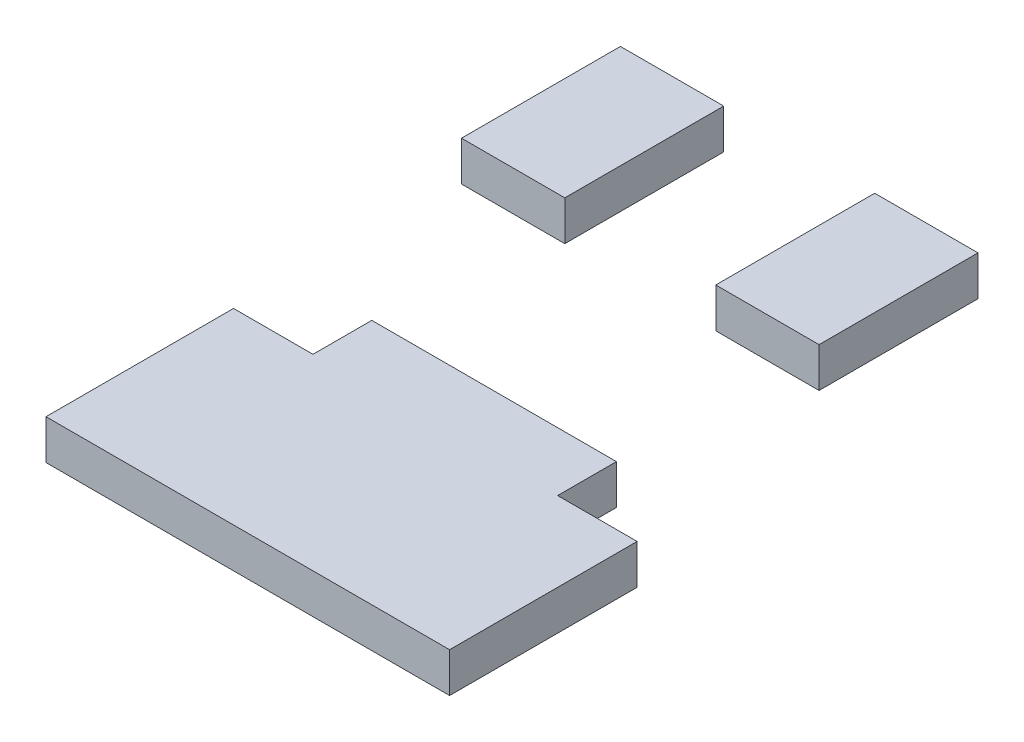
ISO-10303-21;
HEADER;
FILE_DESCRIPTION(('STEP AP214'),'2;1');
FILE_NAME('part.step','',(''),(''),'','','');
FILE_SCHEMA(('AUTOMOTIVE_DESIGN { 1 0 10303 214 1 1 1 1 }'));
ENDSEC;
DATA;
#1=APPLICATION_CONTEXT('core data for automotive mechanical design processes');
#2=APPLICATION_PROTOCOL_DEFINITION('international standard','automotive_design',2000,#1);
#3=PRODUCT_CONTEXT('',#1,'mechanical');
#4=PRODUCT('Part','Part','',(#3));
#5=PRODUCT_RELATED_PRODUCT_CATEGORY('part','',(#4));
#6=PRODUCT_DEFINITION_FORMATION('','',#4);
#7=PRODUCT_DEFINITION_CONTEXT('part definition',#1,'design');
#8=PRODUCT_DEFINITION('design','',#6,#7);
#9=PRODUCT_DEFINITION_SHAPE('','',#8);
#10=(LENGTH_UNIT() NAMED_UNIT(*) SI_UNIT(.MILLI.,.METRE.));
#11=(NAMED_UNIT(*) PLANE_ANGLE_UNIT() SI_UNIT($,.RADIAN.));
#12=(NAMED_UNIT(*) SI_UNIT($,.STERADIAN.) SOLID_ANGLE_UNIT());
#13=UNCERTAINTY_MEASURE_WITH_UNIT(LENGTH_MEASURE(1.E-05),#10,'distance_accuracy_value','');
#14=(GEOMETRIC_REPRESENTATION_CONTEXT(3) GLOBAL_UNCERTAINTY_ASSIGNED_CONTEXT((#13)) GLOBAL_UNIT_ASSIGNED_CONTEXT((#10,
#11,#12)) REPRESENTATION_CONTEXT('',''));
#15=CARTESIAN_POINT('',(0.,0.,0.));
#16=DIRECTION('',(0.,0.,1.));
#17=DIRECTION('',(1.,0.,0.));
#18=AXIS2_PLACEMENT_3D('',#15,#16,#17);
#19=CARTESIAN_POINT('',(15.5,5.,-26.3731039775683));
#20=DIRECTION('',(-1.,0.,0.));
#21=DIRECTION('',(0.,0.,1.));
#22=AXIS2_PLACEMENT_3D('',#19,#20,#21);
#23=PLANE('',#22);
#24=DIRECTION('',(0.,0.,-1.));
#25=VECTOR('',#24,1.);
#26=CARTESIAN_POINT('',(15.5,0.,-26.3731039775683));
#27=LINE('',#26,#25);
#28=CARTESIAN_POINT('',(15.5,0.,-26.3731039775683));
#29=VERTEX_POINT('',#28);
#30=CARTESIAN_POINT('',(15.5,0.,-46.3731039775683));
#31=VERTEX_POINT('',#30);
#32=EDGE_CURVE('E107',#29,#31,#27,.T.);
#33=ORIENTED_EDGE('',*,*,#32,.T.);
#34=DIRECTION('',(0.,-1.,0.));
#35=VECTOR('',#34,1.);
#36=CARTESIAN_POINT('',(15.5,5.,-46.3731039775683));
#37=LINE('',#36,#35);
#38=CARTESIAN_POINT('',(15.5,5.,-46.3731039775683));
#39=VERTEX_POINT('',#38);
#40=EDGE_CURVE('E12',#39,#31,#37,.T.);
#41=ORIENTED_EDGE('',*,*,#40,.F.);
#42=DIRECTION('',(0.,0.,-1.));
#43=VECTOR('',#42,1.);
#44=CARTESIAN_POINT('',(15.5,5.,-26.3731039775683));
#45=LINE('',#44,#43);
#46=CARTESIAN_POINT('',(15.5,5.,-26.3731039775683));
#47=VERTEX_POINT('',#46);
#48=EDGE_CURVE('E95',#47,#39,#45,.T.);
#49=ORIENTED_EDGE('',*,*,#48,.F.);
#50=DIRECTION('',(0.,-1.,0.));
#51=VECTOR('',#50,1.);
#52=CARTESIAN_POINT('',(15.5,5.,-26.3731039775683));
#53=LINE('',#52,#51);
#54=EDGE_CURVE('E103',#47,#29,#53,.T.);
#55=ORIENTED_EDGE('',*,*,#54,.T.);
#56=EDGE_LOOP('',(#33,#41,#49,#55));
#57=FACE_BOUND('',#56,.T.);
#58=ADVANCED_FACE('F44',(#57),#23,.F.);
#59=CARTESIAN_POINT('',(15.5,5.,-46.3731039775683));
#60=DIRECTION('',(0.,0.,1.));
#61=DIRECTION('',(1.,0.,0.));
#62=AXIS2_PLACEMENT_3D('',#59,#60,#61);
#63=PLANE('',#62);
#64=DIRECTION('',(-1.,0.,0.));
#65=VECTOR('',#64,1.);
#66=CARTESIAN_POINT('',(15.5,0.,-46.3731039775683));
#67=LINE('',#66,#65);
#68=CARTESIAN_POINT('',(2.49999999999999,0.,-46.3731039775683));
#69=VERTEX_POINT('',#68);
#70=EDGE_CURVE('E99',#31,#69,#67,.T.);
#71=ORIENTED_EDGE('',*,*,#70,.T.);
#72=DIRECTION('',(0.,-1.,0.));
#73=VECTOR('',#72,1.);
#74=CARTESIAN_POINT('',(2.49999999999999,5.,-46.3731039775683));
#75=LINE('',#74,#73);
#76=CARTESIAN_POINT('',(2.49999999999999,5.,-46.3731039775683));
#77=VERTEX_POINT('',#76);
#78=EDGE_CURVE('E52',#77,#69,#75,.T.);
#79=ORIENTED_EDGE('',*,*,#78,.F.);
#80=DIRECTION('',(-1.,0.,0.));
#81=VECTOR('',#80,1.);
#82=CARTESIAN_POINT('',(15.5,5.,-46.3731039775683));
#83=LINE('',#82,#81);
#84=EDGE_CURVE('E90',#39,#77,#83,.T.);
#85=ORIENTED_EDGE('',*,*,#84,.F.);
#86=ORIENTED_EDGE('',*,*,#40,.T.);
#87=EDGE_LOOP('',(#71,#79,#85,#86));
#88=FACE_BOUND('',#87,.T.);
#89=ADVANCED_FACE('F98',(#88),#63,.F.);
#90=CARTESIAN_POINT('',(2.5,5.,-26.3731039775683));
#91=DIRECTION('',(1.,0.,0.));
#92=DIRECTION('',(0.,0.,-1.));
#93=AXIS2_PLACEMENT_3D('',#90,#91,#92);
#94=PLANE('',#93);
#95=DIRECTION('',(0.,0.,1.));
#96=VECTOR('',#95,1.);
#97=CARTESIAN_POINT('',(2.5,0.,-26.3731039775683));
#98=LINE('',#97,#96);
#99=CARTESIAN_POINT('',(2.5,0.,-26.3731039775683));
#100=VERTEX_POINT('',#99);
#101=EDGE_CURVE('E77',#69,#100,#98,.T.);
#102=ORIENTED_EDGE('',*,*,#101,.T.);
#103=DIRECTION('',(0.,-1.,0.));
#104=VECTOR('',#103,1.);
#105=CARTESIAN_POINT('',(2.5,5.,-26.3731039775683));
#106=LINE('',#105,#104);
#107=CARTESIAN_POINT('',(2.5,5.,-26.3731039775683));
#108=VERTEX_POINT('',#107);
#109=EDGE_CURVE('E100',#108,#100,#106,.T.);
#110=ORIENTED_EDGE('',*,*,#109,.F.);
#111=DIRECTION('',(0.,0.,1.));
#112=VECTOR('',#111,1.);
#113=CARTESIAN_POINT('',(2.5,5.,-26.3731039775683));
#114=LINE('',#113,#112);
#115=EDGE_CURVE('E93',#77,#108,#114,.T.);
#116=ORIENTED_EDGE('',*,*,#115,.F.);
#117=ORIENTED_EDGE('',*,*,#78,.T.);
#118=EDGE_LOOP('',(#102,#110,#116,#117));
#119=FACE_BOUND('',#118,.T.);
#120=ADVANCED_FACE('F101',(#119),#94,.F.);
#121=CARTESIAN_POINT('',(15.5,5.,-26.3731039775683));
#122=DIRECTION('',(0.,0.,-1.));
#123=DIRECTION('',(-1.,0.,0.));
#124=AXIS2_PLACEMENT_3D('',#121,#122,#123);
#125=PLANE('',#124);
#126=DIRECTION('',(1.,0.,0.));
#127=VECTOR('',#126,1.);
#128=CARTESIAN_POINT('',(15.5,0.,-26.3731039775683));
#129=LINE('',#128,#127);
#130=EDGE_CURVE('E83',#100,#29,#129,.T.);
#131=ORIENTED_EDGE('',*,*,#130,.T.);
#132=ORIENTED_EDGE('',*,*,#54,.F.);
#133=DIRECTION('',(1.,0.,0.));
#134=VECTOR('',#133,1.);
#135=CARTESIAN_POINT('',(15.5,5.,-26.3731039775683));
#136=LINE('',#135,#134);
#137=EDGE_CURVE('E60',#108,#47,#136,.T.);
#138=ORIENTED_EDGE('',*,*,#137,.F.);
#139=ORIENTED_EDGE('',*,*,#109,.T.);
#140=EDGE_LOOP('',(#131,#132,#138,#139));
#141=FACE_BOUND('',#140,.T.);
#142=ADVANCED_FACE('F114',(#141),#125,.F.);
#143=CARTESIAN_POINT('',(0.,5.,0.));
#144=DIRECTION('',(0.,1.,0.));
#145=DIRECTION('',(0.,0.,1.));
#146=AXIS2_PLACEMENT_3D('',#143,#144,#145);
#147=PLANE('',#146);
#148=ORIENTED_EDGE('',*,*,#48,.T.);
#149=ORIENTED_EDGE('',*,*,#84,.T.);
#150=ORIENTED_EDGE('',*,*,#115,.T.);
#151=ORIENTED_EDGE('',*,*,#137,.T.);
#152=EDGE_LOOP('',(#148,#149,#150,#151));
#153=FACE_BOUND('',#152,.T.);
#154=ADVANCED_FACE('F91',(#153),#147,.T.);
#155=CARTESIAN_POINT('',(0.,0.,0.));
#156=DIRECTION('',(0.,1.,0.));
#157=DIRECTION('',(0.,0.,1.));
#158=AXIS2_PLACEMENT_3D('',#155,#156,#157);
#159=PLANE('',#158);
#160=ORIENTED_EDGE('',*,*,#32,.F.);
#161=ORIENTED_EDGE('',*,*,#130,.F.);
#162=ORIENTED_EDGE('',*,*,#101,.F.);
#163=ORIENTED_EDGE('',*,*,#70,.F.);
#164=EDGE_LOOP('',(#160,#161,#162,#163));
#165=FACE_BOUND('',#164,.T.);
#166=ADVANCED_FACE('F117',(#165),#159,.F.);
#167=CLOSED_SHELL('',(#58,#89,#120,#142,#154,#166));
#168=MANIFOLD_SOLID_BREP('B2',#167);
#169=CARTESIAN_POINT('',(-16.5,5.,-26.3731039775683));
#170=DIRECTION('',(-1.,0.,0.));
#171=DIRECTION('',(0.,0.,1.));
#172=AXIS2_PLACEMENT_3D('',#169,#170,#171);
#173=PLANE('',#172);
#174=DIRECTION('',(0.,0.,-1.));
#175=VECTOR('',#174,1.);
#176=CARTESIAN_POINT('',(-16.5,0.,-26.3731039775683));
#177=LINE('',#176,#175);
#178=CARTESIAN_POINT('',(-16.5,0.,-26.3731039775683));
#179=VERTEX_POINT('',#178);
#180=CARTESIAN_POINT('',(-16.5,0.,-46.3731039775683));
#181=VERTEX_POINT('',#180);
#182=EDGE_CURVE('E240',#179,#181,#177,.T.);
#183=ORIENTED_EDGE('',*,*,#182,.T.);
#184=DIRECTION('',(0.,-1.,0.));
#185=VECTOR('',#184,1.);
#186=CARTESIAN_POINT('',(-16.5,5.,-46.3731039775683));
#187=LINE('',#186,#185);
#188=CARTESIAN_POINT('',(-16.5,5.,-46.3731039775683));
#189=VERTEX_POINT('',#188);
#190=EDGE_CURVE('E42',#189,#181,#187,.T.);
#191=ORIENTED_EDGE('',*,*,#190,.F.);
#192=DIRECTION('',(0.,0.,-1.));
#193=VECTOR('',#192,1.);
#194=CARTESIAN_POINT('',(-16.5,5.,-26.3731039775683));
#195=LINE('',#194,#193);
#196=CARTESIAN_POINT('',(-16.5,5.,-26.3731039775683));
#197=VERTEX_POINT('',#196);
#198=EDGE_CURVE('E228',#197,#189,#195,.T.);
#199=ORIENTED_EDGE('',*,*,#198,.F.);
#200=DIRECTION('',(0.,-1.,0.));
#201=VECTOR('',#200,1.);
#202=CARTESIAN_POINT('',(-16.5,5.,-26.3731039775683));
#203=LINE('',#202,#201);
#204=EDGE_CURVE('E236',#197,#179,#203,.T.);
#205=ORIENTED_EDGE('',*,*,#204,.T.);
#206=EDGE_LOOP('',(#183,#191,#199,#205));
#207=FACE_BOUND('',#206,.T.);
#208=ADVANCED_FACE('F177',(#207),#173,.F.);
#209=CARTESIAN_POINT('',(-29.5,5.,-46.3731039775683));
#210=DIRECTION('',(0.,0.,1.));
#211=DIRECTION('',(1.,0.,0.));
#212=AXIS2_PLACEMENT_3D('',#209,#210,#211);
#213=PLANE('',#212);
#214=DIRECTION('',(-1.,0.,0.));
#215=VECTOR('',#214,1.);
#216=CARTESIAN_POINT('',(-29.5,0.,-46.3731039775683));
#217=LINE('',#216,#215);
#218=CARTESIAN_POINT('',(-29.5,0.,-46.3731039775683));
#219=VERTEX_POINT('',#218);
#220=EDGE_CURVE('E232',#181,#219,#217,.T.);
#221=ORIENTED_EDGE('',*,*,#220,.T.);
#222=DIRECTION('',(0.,-1.,0.));
#223=VECTOR('',#222,1.);
#224=CARTESIAN_POINT('',(-29.5,5.,-46.3731039775683));
#225=LINE('',#224,#223);
#226=CARTESIAN_POINT('',(-29.5,5.,-46.3731039775683));
#227=VERTEX_POINT('',#226);
#228=EDGE_CURVE('E185',#227,#219,#225,.T.);
#229=ORIENTED_EDGE('',*,*,#228,.F.);
#230=DIRECTION('',(-1.,0.,0.));
#231=VECTOR('',#230,1.);
#232=CARTESIAN_POINT('',(-29.5,5.,-46.3731039775683));
#233=LINE('',#232,#231);
#234=EDGE_CURVE('E223',#189,#227,#233,.T.);
#235=ORIENTED_EDGE('',*,*,#234,.F.);
#236=ORIENTED_EDGE('',*,*,#190,.T.);
#237=EDGE_LOOP('',(#221,#229,#235,#236));
#238=FACE_BOUND('',#237,.T.);
#239=ADVANCED_FACE('F231',(#238),#213,.F.);
#240=CARTESIAN_POINT('',(-29.5,5.,-26.3731039775683));
#241=DIRECTION('',(1.,0.,0.));
#242=DIRECTION('',(0.,0.,-1.));
#243=AXIS2_PLACEMENT_3D('',#240,#241,#242);
#244=PLANE('',#243);
#245=DIRECTION('',(0.,0.,1.));
#246=VECTOR('',#245,1.);
#247=CARTESIAN_POINT('',(-29.5,0.,-26.3731039775683));
#248=LINE('',#247,#246);
#249=CARTESIAN_POINT('',(-29.5,0.,-26.3731039775683));
#250=VERTEX_POINT('',#249);
#251=EDGE_CURVE('E210',#219,#250,#248,.T.);
#252=ORIENTED_EDGE('',*,*,#251,.T.);
#253=DIRECTION('',(0.,-1.,0.));
#254=VECTOR('',#253,1.);
#255=CARTESIAN_POINT('',(-29.5,5.,-26.3731039775683));
#256=LINE('',#255,#254);
#257=CARTESIAN_POINT('',(-29.5,5.,-26.3731039775683));
#258=VERTEX_POINT('',#257);
#259=EDGE_CURVE('E233',#258,#250,#256,.T.);
#260=ORIENTED_EDGE('',*,*,#259,.F.);
#261=DIRECTION('',(0.,0.,1.));
#262=VECTOR('',#261,1.);
#263=CARTESIAN_POINT('',(-29.5,5.,-26.3731039775683));
#264=LINE('',#263,#262);
#265=EDGE_CURVE('E226',#227,#258,#264,.T.);
#266=ORIENTED_EDGE('',*,*,#265,.F.);
#267=ORIENTED_EDGE('',*,*,#228,.T.);
#268=EDGE_LOOP('',(#252,#260,#266,#267));
#269=FACE_BOUND('',#268,.T.);
#270=ADVANCED_FACE('F234',(#269),#244,.F.);
#271=CARTESIAN_POINT('',(-29.5,5.,-26.3731039775683));
#272=DIRECTION('',(0.,0.,-1.));
#273=DIRECTION('',(-1.,0.,0.));
#274=AXIS2_PLACEMENT_3D('',#271,#272,#273);
#275=PLANE('',#274);
#276=DIRECTION('',(1.,0.,0.));
#277=VECTOR('',#276,1.);
#278=CARTESIAN_POINT('',(-29.5,0.,-26.3731039775683));
#279=LINE('',#278,#277);
#280=EDGE_CURVE('E216',#250,#179,#279,.T.);
#281=ORIENTED_EDGE('',*,*,#280,.T.);
#282=ORIENTED_EDGE('',*,*,#204,.F.);
#283=DIRECTION('',(1.,0.,0.));
#284=VECTOR('',#283,1.);
#285=CARTESIAN_POINT('',(-29.5,5.,-26.3731039775683));
#286=LINE('',#285,#284);
#287=EDGE_CURVE('E193',#258,#197,#286,.T.);
#288=ORIENTED_EDGE('',*,*,#287,.F.);
#289=ORIENTED_EDGE('',*,*,#259,.T.);
#290=EDGE_LOOP('',(#281,#282,#288,#289));
#291=FACE_BOUND('',#290,.T.);
#292=ADVANCED_FACE('F247',(#291),#275,.F.);
#293=CARTESIAN_POINT('',(0.,5.,0.));
#294=DIRECTION('',(0.,-1.,0.));
#295=DIRECTION('',(0.,0.,-1.));
#296=AXIS2_PLACEMENT_3D('',#293,#294,#295);
#297=PLANE('',#296);
#298=ORIENTED_EDGE('',*,*,#198,.T.);
#299=ORIENTED_EDGE('',*,*,#234,.T.);
#300=ORIENTED_EDGE('',*,*,#265,.T.);
#301=ORIENTED_EDGE('',*,*,#287,.T.);
#302=EDGE_LOOP('',(#298,#299,#300,#301));
#303=FACE_BOUND('',#302,.T.);
#304=ADVANCED_FACE('F224',(#303),#297,.F.);
#305=CARTESIAN_POINT('',(0.,0.,0.));
#306=DIRECTION('',(0.,-1.,0.));
#307=DIRECTION('',(0.,0.,-1.));
#308=AXIS2_PLACEMENT_3D('',#305,#306,#307);
#309=PLANE('',#308);
#310=ORIENTED_EDGE('',*,*,#182,.F.);
#311=ORIENTED_EDGE('',*,*,#280,.F.);
#312=ORIENTED_EDGE('',*,*,#251,.F.);
#313=ORIENTED_EDGE('',*,*,#220,.F.);
#314=EDGE_LOOP('',(#310,#311,#312,#313));
#315=FACE_BOUND('',#314,.T.);
#316=ADVANCED_FACE('F250',(#315),#309,.T.);
#317=CLOSED_SHELL('',(#208,#239,#270,#292,#304,#316));
#318=MANIFOLD_SOLID_BREP('B6',#317);
#319=CARTESIAN_POINT('',(15.5,5.,-0.873103977568308));
#320=DIRECTION('',(-1.,0.,0.));
#321=DIRECTION('',(0.,0.,1.));
#322=AXIS2_PLACEMENT_3D('',#319,#320,#321);
#323=PLANE('',#322);
#324=DIRECTION('',(0.,0.,-1.));
#325=VECTOR('',#324,1.);
#326=CARTESIAN_POINT('',(15.5,0.,-0.873103977568308));
#327=LINE('',#326,#325);
#328=CARTESIAN_POINT('',(15.5,0.,6.52689602243169));
#329=VERTEX_POINT('',#328);
#330=CARTESIAN_POINT('',(15.5,0.,-0.873103977568308));
#331=VERTEX_POINT('',#330);
#332=EDGE_CURVE('E397',#329,#331,#327,.T.);
#333=ORIENTED_EDGE('',*,*,#332,.T.);
#334=DIRECTION('',(0.,-1.,0.));
#335=VECTOR('',#334,1.);
#336=CARTESIAN_POINT('',(15.5,5.,-0.873103977568308));
#337=LINE('',#336,#335);
#338=CARTESIAN_POINT('',(15.5,5.,-0.873103977568308));
#339=VERTEX_POINT('',#338);
#340=EDGE_CURVE('E175',#339,#331,#337,.T.);
#341=ORIENTED_EDGE('',*,*,#340,.F.);
#342=DIRECTION('',(0.,0.,-1.));
#343=VECTOR('',#342,1.);
#344=CARTESIAN_POINT('',(15.5,5.,-0.873103977568308));
#345=LINE('',#344,#343);
#346=CARTESIAN_POINT('',(15.5,5.,6.52689602243169));
#347=VERTEX_POINT('',#346);
#348=EDGE_CURVE('E411',#347,#339,#345,.T.);
#349=ORIENTED_EDGE('',*,*,#348,.F.);
#350=DIRECTION('',(0.,-1.,0.));
#351=VECTOR('',#350,1.);
#352=CARTESIAN_POINT('',(15.5,5.,6.52689602243169));
#353=LINE('',#352,#351);
#354=EDGE_CURVE('E393',#347,#329,#353,.T.);
#355=ORIENTED_EDGE('',*,*,#354,.T.);
#356=EDGE_LOOP('',(#333,#341,#349,#355));
#357=FACE_BOUND('',#356,.T.);
#358=ADVANCED_FACE('F301',(#357),#323,.F.);
#359=CARTESIAN_POINT('',(-15.2896713797727,5.,-0.873103977568294));
#360=DIRECTION('',(0.,0.,1.));
#361=DIRECTION('',(1.,0.,0.));
#362=AXIS2_PLACEMENT_3D('',#359,#360,#361);
#363=PLANE('',#362);
#364=DIRECTION('',(-1.,0.,0.));
#365=VECTOR('',#364,1.);
#366=CARTESIAN_POINT('',(-15.2896713797727,0.,-0.873103977568294));
#367=LINE('',#366,#365);
#368=CARTESIAN_POINT('',(-15.2896713797727,0.,-0.873103977568294));
#369=VERTEX_POINT('',#368);
#370=EDGE_CURVE('E400',#331,#369,#367,.T.);
#371=ORIENTED_EDGE('',*,*,#370,.T.);
#372=DIRECTION('',(0.,-1.,0.));
#373=VECTOR('',#372,1.);
#374=CARTESIAN_POINT('',(-15.2896713797727,5.,-0.873103977568294));
#375=LINE('',#374,#373);
#376=CARTESIAN_POINT('',(-15.2896713797727,5.,-0.873103977568294));
#377=VERTEX_POINT('',#376);
#378=EDGE_CURVE('E309',#377,#369,#375,.T.);
#379=ORIENTED_EDGE('',*,*,#378,.F.);
#380=DIRECTION('',(-1.,0.,0.));
#381=VECTOR('',#380,1.);
#382=CARTESIAN_POINT('',(-15.2896713797727,5.,-0.873103977568294));
#383=LINE('',#382,#381);
#384=EDGE_CURVE('E360',#339,#377,#383,.T.);
#385=ORIENTED_EDGE('',*,*,#384,.F.);
#386=ORIENTED_EDGE('',*,*,#340,.T.);
#387=EDGE_LOOP('',(#371,#379,#385,#386));
#388=FACE_BOUND('',#387,.T.);
#389=ADVANCED_FACE('F446',(#388),#363,.F.);
#390=CARTESIAN_POINT('',(-15.2896713797727,5.,6.52689602243171));
#391=DIRECTION('',(1.,0.,0.));
#392=DIRECTION('',(0.,0.,-1.));
#393=AXIS2_PLACEMENT_3D('',#390,#391,#392);
#394=PLANE('',#393);
#395=DIRECTION('',(0.,0.,1.));
#396=VECTOR('',#395,1.);
#397=CARTESIAN_POINT('',(-15.2896713797727,0.,6.52689602243171));
#398=LINE('',#397,#396);
#399=CARTESIAN_POINT('',(-15.2896713797727,0.,6.52689602243171));
#400=VERTEX_POINT('',#399);
#401=EDGE_CURVE('E402',#369,#400,#398,.T.);
#402=ORIENTED_EDGE('',*,*,#401,.T.);
#403=DIRECTION('',(0.,-1.,0.));
#404=VECTOR('',#403,1.);
#405=CARTESIAN_POINT('',(-15.2896713797727,5.,6.52689602243171));
#406=LINE('',#405,#404);
#407=CARTESIAN_POINT('',(-15.2896713797727,5.,6.52689602243171));
#408=VERTEX_POINT('',#407);
#409=EDGE_CURVE('E418',#408,#400,#406,.T.);
#410=ORIENTED_EDGE('',*,*,#409,.F.);
#411=DIRECTION('',(0.,0.,1.));
#412=VECTOR('',#411,1.);
#413=CARTESIAN_POINT('',(-15.2896713797727,5.,6.52689602243171));
#414=LINE('',#413,#412);
#415=EDGE_CURVE('E426',#377,#408,#414,.T.);
#416=ORIENTED_EDGE('',*,*,#415,.F.);
#417=ORIENTED_EDGE('',*,*,#378,.T.);
#418=EDGE_LOOP('',(#402,#410,#416,#417));
#419=FACE_BOUND('',#418,.T.);
#420=ADVANCED_FACE('F424',(#419),#394,.F.);
#421=CARTESIAN_POINT('',(-15.2896713797727,5.,6.52689602243171));
#422=DIRECTION('',(0.,0.,1.));
#423=DIRECTION('',(1.,0.,0.));
#424=AXIS2_PLACEMENT_3D('',#421,#422,#423);
#425=PLANE('',#424);
#426=DIRECTION('',(-1.,0.,0.));
#427=VECTOR('',#426,1.);
#428=CARTESIAN_POINT('',(-15.2896713797727,0.,6.52689602243171));
#429=LINE('',#428,#427);
#430=CARTESIAN_POINT('',(-25.2896713797727,0.,6.52689602243169));
#431=VERTEX_POINT('',#430);
#432=EDGE_CURVE('E404',#400,#431,#429,.T.);
#433=ORIENTED_EDGE('',*,*,#432,.T.);
#434=DIRECTION('',(0.,-1.,0.));
#435=VECTOR('',#434,1.);
#436=CARTESIAN_POINT('',(-25.2896713797727,5.,6.52689602243169));
#437=LINE('',#436,#435);
#438=CARTESIAN_POINT('',(-25.2896713797727,5.,6.52689602243169));
#439=VERTEX_POINT('',#438);
#440=EDGE_CURVE('E415',#439,#431,#437,.T.);
#441=ORIENTED_EDGE('',*,*,#440,.F.);
#442=DIRECTION('',(-1.,0.,0.));
#443=VECTOR('',#442,1.);
#444=CARTESIAN_POINT('',(-15.2896713797727,5.,6.52689602243171));
#445=LINE('',#444,#443);
#446=EDGE_CURVE('E438',#408,#439,#445,.T.);
#447=ORIENTED_EDGE('',*,*,#446,.F.);
#448=ORIENTED_EDGE('',*,*,#409,.T.);
#449=EDGE_LOOP('',(#433,#441,#447,#448));
#450=FACE_BOUND('',#449,.T.);
#451=ADVANCED_FACE('F434',(#450),#425,.F.);
#452=CARTESIAN_POINT('',(-25.2896713797727,5.,6.52689602243169));
#453=DIRECTION('',(1.,0.,0.));
#454=DIRECTION('',(0.,0.,-1.));
#455=AXIS2_PLACEMENT_3D('',#452,#453,#454);
#456=PLANE('',#455);
#457=DIRECTION('',(0.,0.,1.));
#458=VECTOR('',#457,1.);
#459=CARTESIAN_POINT('',(-25.2896713797727,0.,6.52689602243169));
#460=LINE('',#459,#458);
#461=CARTESIAN_POINT('',(-25.2896713797727,0.,30.1268960224317));
#462=VERTEX_POINT('',#461);
#463=EDGE_CURVE('E406',#431,#462,#460,.T.);
#464=ORIENTED_EDGE('',*,*,#463,.T.);
#465=DIRECTION('',(0.,-1.,0.));
#466=VECTOR('',#465,1.);
#467=CARTESIAN_POINT('',(-25.2896713797727,5.,30.1268960224317));
#468=LINE('',#467,#466);
#469=CARTESIAN_POINT('',(-25.2896713797727,5.,30.1268960224317));
#470=VERTEX_POINT('',#469);
#471=EDGE_CURVE('E388',#470,#462,#468,.T.);
#472=ORIENTED_EDGE('',*,*,#471,.F.);
#473=DIRECTION('',(0.,0.,1.));
#474=VECTOR('',#473,1.);
#475=CARTESIAN_POINT('',(-25.2896713797727,5.,6.52689602243169));
#476=LINE('',#475,#474);
#477=EDGE_CURVE('E379',#439,#470,#476,.T.);
#478=ORIENTED_EDGE('',*,*,#477,.F.);
#479=ORIENTED_EDGE('',*,*,#440,.T.);
#480=EDGE_LOOP('',(#464,#472,#478,#479));
#481=FACE_BOUND('',#480,.T.);
#482=ADVANCED_FACE('F437',(#481),#456,.F.);
#483=CARTESIAN_POINT('',(25.5,5.,30.1268960224317));
#484=DIRECTION('',(0.,0.,-1.));
#485=DIRECTION('',(-1.,0.,0.));
#486=AXIS2_PLACEMENT_3D('',#483,#484,#485);
#487=PLANE('',#486);
#488=DIRECTION('',(1.,0.,0.));
#489=VECTOR('',#488,1.);
#490=CARTESIAN_POINT('',(25.5,0.,30.1268960224317));
#491=LINE('',#490,#489);
#492=CARTESIAN_POINT('',(25.5,0.,30.1268960224317));
#493=VERTEX_POINT('',#492);
#494=EDGE_CURVE('E387',#462,#493,#491,.T.);
#495=ORIENTED_EDGE('',*,*,#494,.T.);
#496=DIRECTION('',(0.,-1.,0.));
#497=VECTOR('',#496,1.);
#498=CARTESIAN_POINT('',(25.5,5.,30.1268960224317));
#499=LINE('',#498,#497);
#500=CARTESIAN_POINT('',(25.5,5.,30.1268960224317));
#501=VERTEX_POINT('',#500);
#502=EDGE_CURVE('E384',#501,#493,#499,.T.);
#503=ORIENTED_EDGE('',*,*,#502,.F.);
#504=DIRECTION('',(1.,0.,0.));
#505=VECTOR('',#504,1.);
#506=CARTESIAN_POINT('',(25.5,5.,30.1268960224317));
#507=LINE('',#506,#505);
#508=EDGE_CURVE('E373',#470,#501,#507,.T.);
#509=ORIENTED_EDGE('',*,*,#508,.F.);
#510=ORIENTED_EDGE('',*,*,#471,.T.);
#511=EDGE_LOOP('',(#495,#503,#509,#510));
#512=FACE_BOUND('',#511,.T.);
#513=ADVANCED_FACE('F385',(#512),#487,.F.);
#514=CARTESIAN_POINT('',(25.5,5.,6.52689602243169));
#515=DIRECTION('',(-1.,0.,0.));
#516=DIRECTION('',(0.,0.,1.));
#517=AXIS2_PLACEMENT_3D('',#514,#515,#516);
#518=PLANE('',#517);
#519=DIRECTION('',(0.,0.,-1.));
#520=VECTOR('',#519,1.);
#521=CARTESIAN_POINT('',(25.5,0.,6.52689602243169));
#522=LINE('',#521,#520);
#523=CARTESIAN_POINT('',(25.5,0.,6.52689602243169));
#524=VERTEX_POINT('',#523);
#525=EDGE_CURVE('E346',#493,#524,#522,.T.);
#526=ORIENTED_EDGE('',*,*,#525,.T.);
#527=DIRECTION('',(0.,-1.,0.));
#528=VECTOR('',#527,1.);
#529=CARTESIAN_POINT('',(25.5,5.,6.52689602243169));
#530=LINE('',#529,#528);
#531=CARTESIAN_POINT('',(25.5,5.,6.52689602243169));
#532=VERTEX_POINT('',#531);
#533=EDGE_CURVE('E389',#532,#524,#530,.T.);
#534=ORIENTED_EDGE('',*,*,#533,.F.);
#535=DIRECTION('',(0.,0.,-1.));
#536=VECTOR('',#535,1.);
#537=CARTESIAN_POINT('',(25.5,5.,6.52689602243169));
#538=LINE('',#537,#536);
#539=EDGE_CURVE('E377',#501,#532,#538,.T.);
#540=ORIENTED_EDGE('',*,*,#539,.F.);
#541=ORIENTED_EDGE('',*,*,#502,.T.);
#542=EDGE_LOOP('',(#526,#534,#540,#541));
#543=FACE_BOUND('',#542,.T.);
#544=ADVANCED_FACE('F391',(#543),#518,.F.);
#545=CARTESIAN_POINT('',(15.5,5.,6.52689602243169));
#546=DIRECTION('',(0.,0.,1.));
#547=DIRECTION('',(1.,0.,0.));
#548=AXIS2_PLACEMENT_3D('',#545,#546,#547);
#549=PLANE('',#548);
#550=DIRECTION('',(-1.,0.,0.));
#551=VECTOR('',#550,1.);
#552=CARTESIAN_POINT('',(15.5,0.,6.52689602243169));
#553=LINE('',#552,#551);
#554=EDGE_CURVE('E352',#524,#329,#553,.T.);
#555=ORIENTED_EDGE('',*,*,#554,.T.);
#556=ORIENTED_EDGE('',*,*,#354,.F.);
#557=DIRECTION('',(-1.,0.,0.));
#558=VECTOR('',#557,1.);
#559=CARTESIAN_POINT('',(15.5,5.,6.52689602243169));
#560=LINE('',#559,#558);
#561=EDGE_CURVE('E317',#532,#347,#560,.T.);
#562=ORIENTED_EDGE('',*,*,#561,.F.);
#563=ORIENTED_EDGE('',*,*,#533,.T.);
#564=EDGE_LOOP('',(#555,#556,#562,#563));
#565=FACE_BOUND('',#564,.T.);
#566=ADVANCED_FACE('F462',(#565),#549,.F.);
#567=CARTESIAN_POINT('',(0.,5.,0.));
#568=DIRECTION('',(0.,1.,0.));
#569=DIRECTION('',(0.,0.,1.));
#570=AXIS2_PLACEMENT_3D('',#567,#568,#569);
#571=PLANE('',#570);
#572=ORIENTED_EDGE('',*,*,#348,.T.);
#573=ORIENTED_EDGE('',*,*,#384,.T.);
#574=ORIENTED_EDGE('',*,*,#415,.T.);
#575=ORIENTED_EDGE('',*,*,#446,.T.);
#576=ORIENTED_EDGE('',*,*,#477,.T.);
#577=ORIENTED_EDGE('',*,*,#508,.T.);
#578=ORIENTED_EDGE('',*,*,#539,.T.);
#579=ORIENTED_EDGE('',*,*,#561,.T.);
#580=EDGE_LOOP('',(#572,#573,#574,#575,#576,#577,#578,#579));
#581=FACE_BOUND('',#580,.T.);
#582=ADVANCED_FACE('F375',(#581),#571,.T.);
#583=CARTESIAN_POINT('',(0.,0.,0.));
#584=DIRECTION('',(0.,1.,0.));
#585=DIRECTION('',(0.,0.,1.));
#586=AXIS2_PLACEMENT_3D('',#583,#584,#585);
#587=PLANE('',#586);
#588=ORIENTED_EDGE('',*,*,#332,.F.);
#589=ORIENTED_EDGE('',*,*,#554,.F.);
#590=ORIENTED_EDGE('',*,*,#525,.F.);
#591=ORIENTED_EDGE('',*,*,#494,.F.);
#592=ORIENTED_EDGE('',*,*,#463,.F.);
#593=ORIENTED_EDGE('',*,*,#432,.F.);
#594=ORIENTED_EDGE('',*,*,#401,.F.);
#595=ORIENTED_EDGE('',*,*,#370,.F.);
#596=EDGE_LOOP('',(#588,#589,#590,#591,#592,#593,#594,#595));
#597=FACE_BOUND('',#596,.T.);
#598=ADVANCED_FACE('F430',(#597),#587,.F.);
#599=CLOSED_SHELL('',(#358,#389,#420,#451,#482,#513,#544,#566,#582,#598));
#600=MANIFOLD_SOLID_BREP('B36',#599);
#601=ADVANCED_BREP_SHAPE_REPRESENTATION('',(#18,#168,#318,#600),#14);
#602=SHAPE_DEFINITION_REPRESENTATION(#9,#601);
ENDSEC;
END-ISO-10303-21;
